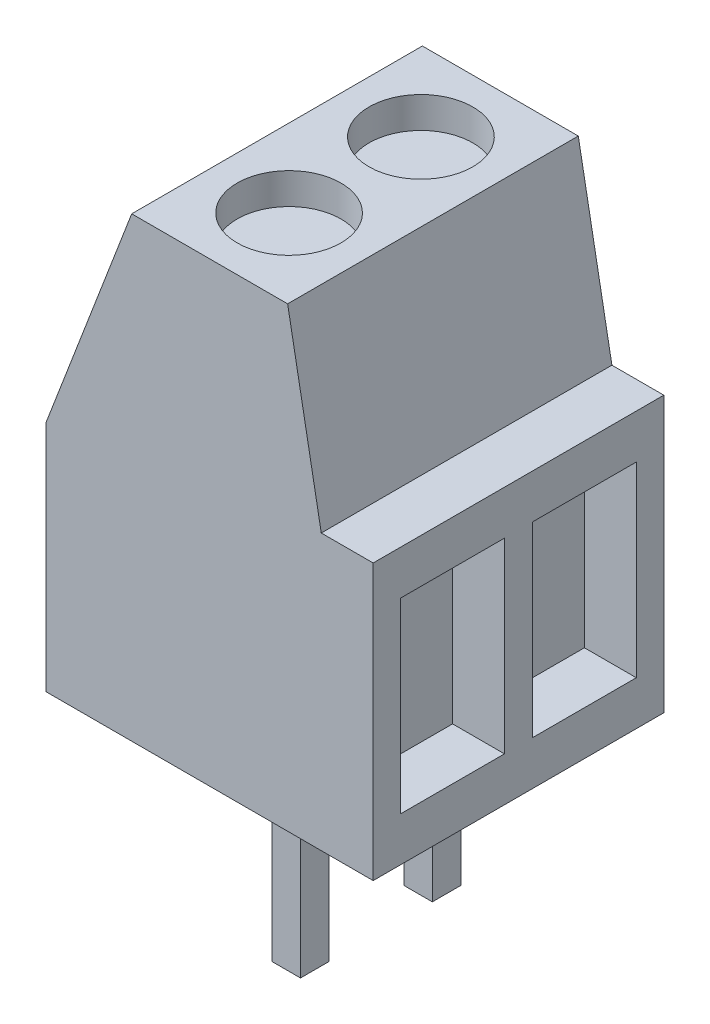
ISO-10303-21;
HEADER;
FILE_DESCRIPTION(('STEP AP214'),'2;1');
FILE_NAME('part.step','',(''),(''),'','','');
FILE_SCHEMA(('AUTOMOTIVE_DESIGN { 1 0 10303 214 1 1 1 1 }'));
ENDSEC;
DATA;
#1=APPLICATION_CONTEXT('core data for automotive mechanical design processes');
#2=APPLICATION_PROTOCOL_DEFINITION('international standard','automotive_design',2000,#1);
#3=PRODUCT_CONTEXT('',#1,'mechanical');
#4=PRODUCT('Part','Part','',(#3));
#5=PRODUCT_RELATED_PRODUCT_CATEGORY('part','',(#4));
#6=PRODUCT_DEFINITION_FORMATION('','',#4);
#7=PRODUCT_DEFINITION_CONTEXT('part definition',#1,'design');
#8=PRODUCT_DEFINITION('design','',#6,#7);
#9=PRODUCT_DEFINITION_SHAPE('','',#8);
#10=(LENGTH_UNIT() NAMED_UNIT(*) SI_UNIT(.MILLI.,.METRE.));
#11=(NAMED_UNIT(*) PLANE_ANGLE_UNIT() SI_UNIT($,.RADIAN.));
#12=(NAMED_UNIT(*) SI_UNIT($,.STERADIAN.) SOLID_ANGLE_UNIT());
#13=UNCERTAINTY_MEASURE_WITH_UNIT(LENGTH_MEASURE(1.E-05),#10,'distance_accuracy_value','');
#14=(GEOMETRIC_REPRESENTATION_CONTEXT(3) GLOBAL_UNCERTAINTY_ASSIGNED_CONTEXT((#13)) GLOBAL_UNIT_ASSIGNED_CONTEXT((#10,
#11,#12)) REPRESENTATION_CONTEXT('',''));
#15=CARTESIAN_POINT('',(0.,0.,0.));
#16=DIRECTION('',(0.,0.,1.));
#17=DIRECTION('',(1.,0.,0.));
#18=AXIS2_PLACEMENT_3D('',#15,#16,#17);
#19=CARTESIAN_POINT('',(2.87500000000013,-3.8,-4.015));
#20=DIRECTION('',(0.,0.,-1.));
#21=DIRECTION('',(-1.,0.,0.));
#22=AXIS2_PLACEMENT_3D('',#19,#20,#21);
#23=PLANE('',#22);
#24=DIRECTION('',(-1.,0.,0.));
#25=VECTOR('',#24,1.);
#26=CARTESIAN_POINT('',(2.87500000000013,0.,-4.015));
#27=LINE('',#26,#25);
#28=CARTESIAN_POINT('',(3.42500000000013,0.,-4.015));
#29=VERTEX_POINT('',#28);
#30=CARTESIAN_POINT('',(2.87500000000013,0.,-4.015));
#31=VERTEX_POINT('',#30);
#32=EDGE_CURVE('E108',#29,#31,#27,.T.);
#33=ORIENTED_EDGE('',*,*,#32,.T.);
#34=DIRECTION('',(0.,1.,0.));
#35=VECTOR('',#34,1.);
#36=CARTESIAN_POINT('',(2.87500000000013,-3.8,-4.015));
#37=LINE('',#36,#35);
#38=CARTESIAN_POINT('',(2.87500000000013,-3.8,-4.015));
#39=VERTEX_POINT('',#38);
#40=EDGE_CURVE('E12',#39,#31,#37,.T.);
#41=ORIENTED_EDGE('',*,*,#40,.F.);
#42=DIRECTION('',(-1.,0.,0.));
#43=VECTOR('',#42,1.);
#44=CARTESIAN_POINT('',(2.87500000000013,-3.8,-4.015));
#45=LINE('',#44,#43);
#46=CARTESIAN_POINT('',(3.42500000000013,-3.8,-4.015));
#47=VERTEX_POINT('',#46);
#48=EDGE_CURVE('E96',#47,#39,#45,.T.);
#49=ORIENTED_EDGE('',*,*,#48,.F.);
#50=DIRECTION('',(0.,1.,0.));
#51=VECTOR('',#50,1.);
#52=CARTESIAN_POINT('',(3.42500000000013,-3.8,-4.015));
#53=LINE('',#52,#51);
#54=EDGE_CURVE('E104',#47,#29,#53,.T.);
#55=ORIENTED_EDGE('',*,*,#54,.T.);
#56=EDGE_LOOP('',(#33,#41,#49,#55));
#57=FACE_BOUND('',#56,.T.);
#58=ADVANCED_FACE('F45',(#57),#23,.F.);
#59=CARTESIAN_POINT('',(2.87500000000013,-3.8,-4.015));
#60=DIRECTION('',(1.,0.,0.));
#61=DIRECTION('',(0.,1.,0.));
#62=AXIS2_PLACEMENT_3D('',#59,#60,#61);
#63=PLANE('',#62);
#64=DIRECTION('',(0.,0.,-1.));
#65=VECTOR('',#64,1.);
#66=CARTESIAN_POINT('',(2.87500000000013,0.,-4.015));
#67=LINE('',#66,#65);
#68=CARTESIAN_POINT('',(2.87500000000013,0.,-4.565));
#69=VERTEX_POINT('',#68);
#70=EDGE_CURVE('E100',#31,#69,#67,.T.);
#71=ORIENTED_EDGE('',*,*,#70,.T.);
#72=DIRECTION('',(0.,1.,0.));
#73=VECTOR('',#72,1.);
#74=CARTESIAN_POINT('',(2.87500000000013,-3.8,-4.565));
#75=LINE('',#74,#73);
#76=CARTESIAN_POINT('',(2.87500000000013,-3.8,-4.565));
#77=VERTEX_POINT('',#76);
#78=EDGE_CURVE('E53',#77,#69,#75,.T.);
#79=ORIENTED_EDGE('',*,*,#78,.F.);
#80=DIRECTION('',(0.,0.,-1.));
#81=VECTOR('',#80,1.);
#82=CARTESIAN_POINT('',(2.87500000000013,-3.8,-4.015));
#83=LINE('',#82,#81);
#84=EDGE_CURVE('E91',#39,#77,#83,.T.);
#85=ORIENTED_EDGE('',*,*,#84,.F.);
#86=ORIENTED_EDGE('',*,*,#40,.T.);
#87=EDGE_LOOP('',(#71,#79,#85,#86));
#88=FACE_BOUND('',#87,.T.);
#89=ADVANCED_FACE('F99',(#88),#63,.F.);
#90=CARTESIAN_POINT('',(2.87500000000013,-3.8,-4.565));
#91=DIRECTION('',(0.,0.,1.));
#92=DIRECTION('',(1.,0.,0.));
#93=AXIS2_PLACEMENT_3D('',#90,#91,#92);
#94=PLANE('',#93);
#95=DIRECTION('',(1.,0.,0.));
#96=VECTOR('',#95,1.);
#97=CARTESIAN_POINT('',(2.87500000000013,0.,-4.565));
#98=LINE('',#97,#96);
#99=CARTESIAN_POINT('',(3.42500000000013,0.,-4.565));
#100=VERTEX_POINT('',#99);
#101=EDGE_CURVE('E78',#69,#100,#98,.T.);
#102=ORIENTED_EDGE('',*,*,#101,.T.);
#103=DIRECTION('',(0.,1.,0.));
#104=VECTOR('',#103,1.);
#105=CARTESIAN_POINT('',(3.42500000000013,-3.8,-4.565));
#106=LINE('',#105,#104);
#107=CARTESIAN_POINT('',(3.42500000000013,-3.8,-4.565));
#108=VERTEX_POINT('',#107);
#109=EDGE_CURVE('E101',#108,#100,#106,.T.);
#110=ORIENTED_EDGE('',*,*,#109,.F.);
#111=DIRECTION('',(1.,0.,0.));
#112=VECTOR('',#111,1.);
#113=CARTESIAN_POINT('',(2.87500000000013,-3.8,-4.565));
#114=LINE('',#113,#112);
#115=EDGE_CURVE('E94',#77,#108,#114,.T.);
#116=ORIENTED_EDGE('',*,*,#115,.F.);
#117=ORIENTED_EDGE('',*,*,#78,.T.);
#118=EDGE_LOOP('',(#102,#110,#116,#117));
#119=FACE_BOUND('',#118,.T.);
#120=ADVANCED_FACE('F102',(#119),#94,.F.);
#121=CARTESIAN_POINT('',(3.42500000000013,-3.8,-4.015));
#122=DIRECTION('',(-1.,0.,0.));
#123=DIRECTION('',(0.,-1.,0.));
#124=AXIS2_PLACEMENT_3D('',#121,#122,#123);
#125=PLANE('',#124);
#126=DIRECTION('',(0.,0.,1.));
#127=VECTOR('',#126,1.);
#128=CARTESIAN_POINT('',(3.42500000000013,0.,-4.015));
#129=LINE('',#128,#127);
#130=EDGE_CURVE('E84',#100,#29,#129,.T.);
#131=ORIENTED_EDGE('',*,*,#130,.T.);
#132=ORIENTED_EDGE('',*,*,#54,.F.);
#133=DIRECTION('',(0.,0.,1.));
#134=VECTOR('',#133,1.);
#135=CARTESIAN_POINT('',(3.42500000000013,-3.8,-4.015));
#136=LINE('',#135,#134);
#137=EDGE_CURVE('E61',#108,#47,#136,.T.);
#138=ORIENTED_EDGE('',*,*,#137,.F.);
#139=ORIENTED_EDGE('',*,*,#109,.T.);
#140=EDGE_LOOP('',(#131,#132,#138,#139));
#141=FACE_BOUND('',#140,.T.);
#142=ADVANCED_FACE('F115',(#141),#125,.F.);
#143=CARTESIAN_POINT('',(0.,-3.8,0.));
#144=DIRECTION('',(0.,1.,0.));
#145=DIRECTION('',(-1.,0.,0.));
#146=AXIS2_PLACEMENT_3D('',#143,#144,#145);
#147=PLANE('',#146);
#148=ORIENTED_EDGE('',*,*,#48,.T.);
#149=ORIENTED_EDGE('',*,*,#84,.T.);
#150=ORIENTED_EDGE('',*,*,#115,.T.);
#151=ORIENTED_EDGE('',*,*,#137,.T.);
#152=EDGE_LOOP('',(#148,#149,#150,#151));
#153=FACE_BOUND('',#152,.T.);
#154=ADVANCED_FACE('F92',(#153),#147,.F.);
#155=CARTESIAN_POINT('',(0.,0.,0.));
#156=DIRECTION('',(0.,1.,0.));
#157=DIRECTION('',(-1.,0.,0.));
#158=AXIS2_PLACEMENT_3D('',#155,#156,#157);
#159=PLANE('',#158);
#160=ORIENTED_EDGE('',*,*,#32,.F.);
#161=ORIENTED_EDGE('',*,*,#130,.F.);
#162=ORIENTED_EDGE('',*,*,#101,.F.);
#163=ORIENTED_EDGE('',*,*,#70,.F.);
#164=EDGE_LOOP('',(#160,#161,#162,#163));
#165=FACE_BOUND('',#164,.T.);
#166=ADVANCED_FACE('F118',(#165),#159,.T.);
#167=CLOSED_SHELL('',(#58,#89,#120,#142,#154,#166));
#168=MANIFOLD_SOLID_BREP('B2',#167);
#169=CARTESIAN_POINT('',(2.875,-3.8,-1.475));
#170=DIRECTION('',(1.,0.,0.));
#171=DIRECTION('',(0.,1.,0.));
#172=AXIS2_PLACEMENT_3D('',#169,#170,#171);
#173=PLANE('',#172);
#174=DIRECTION('',(0.,0.,-1.));
#175=VECTOR('',#174,1.);
#176=CARTESIAN_POINT('',(2.875,0.,-1.475));
#177=LINE('',#176,#175);
#178=CARTESIAN_POINT('',(2.875,0.,-1.475));
#179=VERTEX_POINT('',#178);
#180=CARTESIAN_POINT('',(2.875,0.,-2.025));
#181=VERTEX_POINT('',#180);
#182=EDGE_CURVE('E240',#179,#181,#177,.T.);
#183=ORIENTED_EDGE('',*,*,#182,.T.);
#184=DIRECTION('',(0.,1.,0.));
#185=VECTOR('',#184,1.);
#186=CARTESIAN_POINT('',(2.875,-3.8,-2.025));
#187=LINE('',#186,#185);
#188=CARTESIAN_POINT('',(2.875,-3.8,-2.025));
#189=VERTEX_POINT('',#188);
#190=EDGE_CURVE('E43',#189,#181,#187,.T.);
#191=ORIENTED_EDGE('',*,*,#190,.F.);
#192=DIRECTION('',(0.,0.,-1.));
#193=VECTOR('',#192,1.);
#194=CARTESIAN_POINT('',(2.875,-3.8,-1.475));
#195=LINE('',#194,#193);
#196=CARTESIAN_POINT('',(2.875,-3.8,-1.475));
#197=VERTEX_POINT('',#196);
#198=EDGE_CURVE('E228',#197,#189,#195,.T.);
#199=ORIENTED_EDGE('',*,*,#198,.F.);
#200=DIRECTION('',(0.,1.,0.));
#201=VECTOR('',#200,1.);
#202=CARTESIAN_POINT('',(2.875,-3.8,-1.475));
#203=LINE('',#202,#201);
#204=EDGE_CURVE('E236',#197,#179,#203,.T.);
#205=ORIENTED_EDGE('',*,*,#204,.T.);
#206=EDGE_LOOP('',(#183,#191,#199,#205));
#207=FACE_BOUND('',#206,.T.);
#208=ADVANCED_FACE('F177',(#207),#173,.F.);
#209=CARTESIAN_POINT('',(2.875,-3.8,-2.025));
#210=DIRECTION('',(0.,0.,1.));
#211=DIRECTION('',(1.,0.,0.));
#212=AXIS2_PLACEMENT_3D('',#209,#210,#211);
#213=PLANE('',#212);
#214=DIRECTION('',(1.,0.,0.));
#215=VECTOR('',#214,1.);
#216=CARTESIAN_POINT('',(2.875,0.,-2.025));
#217=LINE('',#216,#215);
#218=CARTESIAN_POINT('',(3.425,0.,-2.025));
#219=VERTEX_POINT('',#218);
#220=EDGE_CURVE('E232',#181,#219,#217,.T.);
#221=ORIENTED_EDGE('',*,*,#220,.T.);
#222=DIRECTION('',(0.,1.,0.));
#223=VECTOR('',#222,1.);
#224=CARTESIAN_POINT('',(3.425,-3.8,-2.025));
#225=LINE('',#224,#223);
#226=CARTESIAN_POINT('',(3.425,-3.8,-2.025));
#227=VERTEX_POINT('',#226);
#228=EDGE_CURVE('E185',#227,#219,#225,.T.);
#229=ORIENTED_EDGE('',*,*,#228,.F.);
#230=DIRECTION('',(1.,0.,0.));
#231=VECTOR('',#230,1.);
#232=CARTESIAN_POINT('',(2.875,-3.8,-2.025));
#233=LINE('',#232,#231);
#234=EDGE_CURVE('E223',#189,#227,#233,.T.);
#235=ORIENTED_EDGE('',*,*,#234,.F.);
#236=ORIENTED_EDGE('',*,*,#190,.T.);
#237=EDGE_LOOP('',(#221,#229,#235,#236));
#238=FACE_BOUND('',#237,.T.);
#239=ADVANCED_FACE('F231',(#238),#213,.F.);
#240=CARTESIAN_POINT('',(3.425,-3.8,-1.475));
#241=DIRECTION('',(-1.,0.,0.));
#242=DIRECTION('',(0.,-1.,0.));
#243=AXIS2_PLACEMENT_3D('',#240,#241,#242);
#244=PLANE('',#243);
#245=DIRECTION('',(0.,0.,1.));
#246=VECTOR('',#245,1.);
#247=CARTESIAN_POINT('',(3.425,0.,-1.475));
#248=LINE('',#247,#246);
#249=CARTESIAN_POINT('',(3.425,0.,-1.475));
#250=VERTEX_POINT('',#249);
#251=EDGE_CURVE('E210',#219,#250,#248,.T.);
#252=ORIENTED_EDGE('',*,*,#251,.T.);
#253=DIRECTION('',(0.,1.,0.));
#254=VECTOR('',#253,1.);
#255=CARTESIAN_POINT('',(3.425,-3.8,-1.475));
#256=LINE('',#255,#254);
#257=CARTESIAN_POINT('',(3.425,-3.8,-1.475));
#258=VERTEX_POINT('',#257);
#259=EDGE_CURVE('E233',#258,#250,#256,.T.);
#260=ORIENTED_EDGE('',*,*,#259,.F.);
#261=DIRECTION('',(0.,0.,1.));
#262=VECTOR('',#261,1.);
#263=CARTESIAN_POINT('',(3.425,-3.8,-1.475));
#264=LINE('',#263,#262);
#265=EDGE_CURVE('E226',#227,#258,#264,.T.);
#266=ORIENTED_EDGE('',*,*,#265,.F.);
#267=ORIENTED_EDGE('',*,*,#228,.T.);
#268=EDGE_LOOP('',(#252,#260,#266,#267));
#269=FACE_BOUND('',#268,.T.);
#270=ADVANCED_FACE('F234',(#269),#244,.F.);
#271=CARTESIAN_POINT('',(2.875,-3.8,-1.475));
#272=DIRECTION('',(0.,0.,-1.));
#273=DIRECTION('',(-1.,0.,0.));
#274=AXIS2_PLACEMENT_3D('',#271,#272,#273);
#275=PLANE('',#274);
#276=DIRECTION('',(-1.,0.,0.));
#277=VECTOR('',#276,1.);
#278=CARTESIAN_POINT('',(2.875,0.,-1.475));
#279=LINE('',#278,#277);
#280=EDGE_CURVE('E216',#250,#179,#279,.T.);
#281=ORIENTED_EDGE('',*,*,#280,.T.);
#282=ORIENTED_EDGE('',*,*,#204,.F.);
#283=DIRECTION('',(-1.,0.,0.));
#284=VECTOR('',#283,1.);
#285=CARTESIAN_POINT('',(2.875,-3.8,-1.475));
#286=LINE('',#285,#284);
#287=EDGE_CURVE('E193',#258,#197,#286,.T.);
#288=ORIENTED_EDGE('',*,*,#287,.F.);
#289=ORIENTED_EDGE('',*,*,#259,.T.);
#290=EDGE_LOOP('',(#281,#282,#288,#289));
#291=FACE_BOUND('',#290,.T.);
#292=ADVANCED_FACE('F247',(#291),#275,.F.);
#293=CARTESIAN_POINT('',(0.,-3.8,0.));
#294=DIRECTION('',(0.,-1.,0.));
#295=DIRECTION('',(1.,0.,0.));
#296=AXIS2_PLACEMENT_3D('',#293,#294,#295);
#297=PLANE('',#296);
#298=ORIENTED_EDGE('',*,*,#198,.T.);
#299=ORIENTED_EDGE('',*,*,#234,.T.);
#300=ORIENTED_EDGE('',*,*,#265,.T.);
#301=ORIENTED_EDGE('',*,*,#287,.T.);
#302=EDGE_LOOP('',(#298,#299,#300,#301));
#303=FACE_BOUND('',#302,.T.);
#304=ADVANCED_FACE('F224',(#303),#297,.T.);
#305=CARTESIAN_POINT('',(0.,0.,0.));
#306=DIRECTION('',(0.,-1.,0.));
#307=DIRECTION('',(1.,0.,0.));
#308=AXIS2_PLACEMENT_3D('',#305,#306,#307);
#309=PLANE('',#308);
#310=ORIENTED_EDGE('',*,*,#182,.F.);
#311=ORIENTED_EDGE('',*,*,#280,.F.);
#312=ORIENTED_EDGE('',*,*,#251,.F.);
#313=ORIENTED_EDGE('',*,*,#220,.F.);
#314=EDGE_LOOP('',(#310,#311,#312,#313));
#315=FACE_BOUND('',#314,.T.);
#316=ADVANCED_FACE('F250',(#315),#309,.F.);
#317=CLOSED_SHELL('',(#208,#239,#270,#292,#304,#316));
#318=MANIFOLD_SOLID_BREP('B6',#317);
#319=CARTESIAN_POINT('',(0.,4.5,-5.6));
#320=DIRECTION('',(-1.,0.,0.));
#321=DIRECTION('',(0.,-1.,0.));
#322=AXIS2_PLACEMENT_3D('',#319,#320,#321);
#323=PLANE('',#322);
#324=DIRECTION('',(0.,-1.,0.));
#325=VECTOR('',#324,1.);
#326=CARTESIAN_POINT('',(0.,4.5,0.));
#327=LINE('',#326,#325);
#328=CARTESIAN_POINT('',(0.,4.5,0.));
#329=VERTEX_POINT('',#328);
#330=CARTESIAN_POINT('',(0.,0.,0.));
#331=VERTEX_POINT('',#330);
#332=EDGE_CURVE('E479',#329,#331,#327,.T.);
#333=ORIENTED_EDGE('',*,*,#332,.F.);
#334=DIRECTION('',(0.,0.,1.));
#335=VECTOR('',#334,1.);
#336=CARTESIAN_POINT('',(0.,4.5,-5.6));
#337=LINE('',#336,#335);
#338=CARTESIAN_POINT('',(0.,4.5,-5.6));
#339=VERTEX_POINT('',#338);
#340=EDGE_CURVE('E175',#339,#329,#337,.T.);
#341=ORIENTED_EDGE('',*,*,#340,.F.);
#342=DIRECTION('',(0.,-1.,0.));
#343=VECTOR('',#342,1.);
#344=CARTESIAN_POINT('',(0.,4.5,-5.6));
#345=LINE('',#344,#343);
#346=CARTESIAN_POINT('',(0.,0.,-5.6));
#347=VERTEX_POINT('',#346);
#348=EDGE_CURVE('E488',#339,#347,#345,.T.);
#349=ORIENTED_EDGE('',*,*,#348,.T.);
#350=DIRECTION('',(0.,0.,1.));
#351=VECTOR('',#350,1.);
#352=CARTESIAN_POINT('',(0.,0.,-5.6));
#353=LINE('',#352,#351);
#354=EDGE_CURVE('E303',#347,#331,#353,.T.);
#355=ORIENTED_EDGE('',*,*,#354,.T.);
#356=EDGE_LOOP('',(#333,#341,#349,#355));
#357=FACE_BOUND('',#356,.T.);
#358=ADVANCED_FACE('F300',(#357),#323,.T.);
#359=CARTESIAN_POINT('',(1.64791190796987,8.8,-5.6));
#360=DIRECTION('',(-0.933776700369476,0.357856219517132,0.));
#361=DIRECTION('',(-0.357856219517132,-0.933776700369476,0.));
#362=AXIS2_PLACEMENT_3D('',#359,#360,#361);
#363=PLANE('',#362);
#364=DIRECTION('',(-0.357856219517132,-0.933776700369476,0.));
#365=VECTOR('',#364,1.);
#366=CARTESIAN_POINT('',(1.64791190796987,8.8,0.));
#367=LINE('',#366,#365);
#368=CARTESIAN_POINT('',(1.64791190796987,8.8,0.));
#369=VERTEX_POINT('',#368);
#370=EDGE_CURVE('E492',#369,#329,#367,.T.);
#371=ORIENTED_EDGE('',*,*,#370,.F.);
#372=DIRECTION('',(0.,0.,1.));
#373=VECTOR('',#372,1.);
#374=CARTESIAN_POINT('',(1.64791190796987,8.8,-5.6));
#375=LINE('',#374,#373);
#376=CARTESIAN_POINT('',(1.64791190796987,8.8,-5.6));
#377=VERTEX_POINT('',#376);
#378=EDGE_CURVE('E308',#377,#369,#375,.T.);
#379=ORIENTED_EDGE('',*,*,#378,.F.);
#380=DIRECTION('',(-0.357856219517132,-0.933776700369476,0.));
#381=VECTOR('',#380,1.);
#382=CARTESIAN_POINT('',(1.64791190796987,8.8,-5.6));
#383=LINE('',#382,#381);
#384=EDGE_CURVE('E507',#377,#339,#383,.T.);
#385=ORIENTED_EDGE('',*,*,#384,.T.);
#386=ORIENTED_EDGE('',*,*,#340,.T.);
#387=EDGE_LOOP('',(#371,#379,#385,#386));
#388=FACE_BOUND('',#387,.T.);
#389=ADVANCED_FACE('F549',(#388),#363,.T.);
#390=CARTESIAN_POINT('',(4.65208809203013,8.8,-5.6));
#391=DIRECTION('',(0.,1.,0.));
#392=DIRECTION('',(0.,0.,1.));
#393=AXIS2_PLACEMENT_3D('',#390,#391,#392);
#394=PLANE('',#393);
#395=CARTESIAN_POINT('',(3.15,8.8,-1.53));
#396=DIRECTION('',(0.,1.,0.));
#397=DIRECTION('',(0.,0.,1.));
#398=AXIS2_PLACEMENT_3D('',#395,#396,#397);
#399=CIRCLE('',#398,0.999999999999999);
#400=CARTESIAN_POINT('',(3.15,8.8,-0.530000000000002));
#401=VERTEX_POINT('',#400);
#402=EDGE_CURVE('E480',#401,#401,#399,.T.);
#403=ORIENTED_EDGE('',*,*,#402,.F.);
#404=EDGE_LOOP('',(#403));
#405=FACE_BOUND('',#404,.T.);
#406=CARTESIAN_POINT('',(3.14999999999999,8.8,-4.07));
#407=DIRECTION('',(0.,1.,0.));
#408=DIRECTION('',(0.,0.,1.));
#409=AXIS2_PLACEMENT_3D('',#406,#407,#408);
#410=CIRCLE('',#409,0.999999999999999);
#411=CARTESIAN_POINT('',(3.14999999999999,8.8,-3.07));
#412=VERTEX_POINT('',#411);
#413=EDGE_CURVE('E443',#412,#412,#410,.T.);
#414=ORIENTED_EDGE('',*,*,#413,.F.);
#415=EDGE_LOOP('',(#414));
#416=FACE_BOUND('',#415,.T.);
#417=DIRECTION('',(-1.,0.,0.));
#418=VECTOR('',#417,1.);
#419=CARTESIAN_POINT('',(4.65208809203013,8.8,0.));
#420=LINE('',#419,#418);
#421=CARTESIAN_POINT('',(4.65208809203013,8.8,0.));
#422=VERTEX_POINT('',#421);
#423=EDGE_CURVE('E524',#422,#369,#420,.T.);
#424=ORIENTED_EDGE('',*,*,#423,.F.);
#425=DIRECTION('',(0.,0.,1.));
#426=VECTOR('',#425,1.);
#427=CARTESIAN_POINT('',(4.65208809203013,8.8,-5.6));
#428=LINE('',#427,#426);
#429=CARTESIAN_POINT('',(4.65208809203013,8.8,-5.6));
#430=VERTEX_POINT('',#429);
#431=EDGE_CURVE('E530',#430,#422,#428,.T.);
#432=ORIENTED_EDGE('',*,*,#431,.F.);
#433=DIRECTION('',(-1.,0.,0.));
#434=VECTOR('',#433,1.);
#435=CARTESIAN_POINT('',(4.65208809203013,8.8,-5.6));
#436=LINE('',#435,#434);
#437=EDGE_CURVE('E504',#430,#377,#436,.T.);
#438=ORIENTED_EDGE('',*,*,#437,.T.);
#439=ORIENTED_EDGE('',*,*,#378,.T.);
#440=EDGE_LOOP('',(#424,#432,#438,#439));
#441=FACE_BOUND('',#440,.T.);
#442=ADVANCED_FACE('F566',(#405,#416,#441),#394,.T.);
#443=CARTESIAN_POINT('',(5.3,5.3,-5.6));
#444=DIRECTION('',(0.983293886037877,0.182025090799402,0.));
#445=DIRECTION('',(-0.182025090799402,0.983293886037877,0.));
#446=AXIS2_PLACEMENT_3D('',#443,#444,#445);
#447=PLANE('',#446);
#448=DIRECTION('',(-0.182025090799402,0.983293886037877,0.));
#449=VECTOR('',#448,1.);
#450=CARTESIAN_POINT('',(5.3,5.3,0.));
#451=LINE('',#450,#449);
#452=CARTESIAN_POINT('',(5.3,5.3,0.));
#453=VERTEX_POINT('',#452);
#454=EDGE_CURVE('E521',#453,#422,#451,.T.);
#455=ORIENTED_EDGE('',*,*,#454,.F.);
#456=DIRECTION('',(0.,0.,1.));
#457=VECTOR('',#456,1.);
#458=CARTESIAN_POINT('',(5.3,5.3,-5.6));
#459=LINE('',#458,#457);
#460=CARTESIAN_POINT('',(5.3,5.3,-5.6));
#461=VERTEX_POINT('',#460);
#462=EDGE_CURVE('E532',#461,#453,#459,.T.);
#463=ORIENTED_EDGE('',*,*,#462,.F.);
#464=DIRECTION('',(-0.182025090799402,0.983293886037877,0.));
#465=VECTOR('',#464,1.);
#466=CARTESIAN_POINT('',(5.3,5.3,-5.6));
#467=LINE('',#466,#465);
#468=EDGE_CURVE('E501',#461,#430,#467,.T.);
#469=ORIENTED_EDGE('',*,*,#468,.T.);
#470=ORIENTED_EDGE('',*,*,#431,.T.);
#471=EDGE_LOOP('',(#455,#463,#469,#470));
#472=FACE_BOUND('',#471,.T.);
#473=ADVANCED_FACE('F564',(#472),#447,.T.);
#474=CARTESIAN_POINT('',(6.3,5.3,-5.6));
#475=DIRECTION('',(0.,1.,0.));
#476=DIRECTION('',(0.,0.,1.));
#477=AXIS2_PLACEMENT_3D('',#474,#475,#476);
#478=PLANE('',#477);
#479=DIRECTION('',(-1.,0.,0.));
#480=VECTOR('',#479,1.);
#481=CARTESIAN_POINT('',(6.3,5.3,0.));
#482=LINE('',#481,#480);
#483=CARTESIAN_POINT('',(6.3,5.3,0.));
#484=VERTEX_POINT('',#483);
#485=EDGE_CURVE('E518',#484,#453,#482,.T.);
#486=ORIENTED_EDGE('',*,*,#485,.F.);
#487=DIRECTION('',(0.,0.,1.));
#488=VECTOR('',#487,1.);
#489=CARTESIAN_POINT('',(6.3,5.3,-5.6));
#490=LINE('',#489,#488);
#491=CARTESIAN_POINT('',(6.3,5.3,-5.6));
#492=VERTEX_POINT('',#491);
#493=EDGE_CURVE('E534',#492,#484,#490,.T.);
#494=ORIENTED_EDGE('',*,*,#493,.F.);
#495=DIRECTION('',(-1.,0.,0.));
#496=VECTOR('',#495,1.);
#497=CARTESIAN_POINT('',(6.3,5.3,-5.6));
#498=LINE('',#497,#496);
#499=EDGE_CURVE('E498',#492,#461,#498,.T.);
#500=ORIENTED_EDGE('',*,*,#499,.T.);
#501=ORIENTED_EDGE('',*,*,#462,.T.);
#502=EDGE_LOOP('',(#486,#494,#500,#501));
#503=FACE_BOUND('',#502,.T.);
#504=ADVANCED_FACE('F562',(#503),#478,.T.);
#505=CARTESIAN_POINT('',(6.3,5.3,-5.6));
#506=DIRECTION('',(1.,0.,0.));
#507=DIRECTION('',(0.,0.,-1.));
#508=AXIS2_PLACEMENT_3D('',#505,#506,#507);
#509=PLANE('',#508);
#510=DIRECTION('',(0.,-1.,0.));
#511=VECTOR('',#510,1.);
#512=CARTESIAN_POINT('',(6.3,0.85,-0.53));
#513=LINE('',#512,#511);
#514=CARTESIAN_POINT('',(6.3,4.45,-0.53));
#515=VERTEX_POINT('',#514);
#516=CARTESIAN_POINT('',(6.3,0.85,-0.529999999999999));
#517=VERTEX_POINT('',#516);
#518=EDGE_CURVE('E316',#515,#517,#513,.T.);
#519=ORIENTED_EDGE('',*,*,#518,.F.);
#520=DIRECTION('',(0.,0.,1.));
#521=VECTOR('',#520,1.);
#522=CARTESIAN_POINT('',(6.3,4.45,-0.53));
#523=LINE('',#522,#521);
#524=CARTESIAN_POINT('',(6.3,4.45,-2.53));
#525=VERTEX_POINT('',#524);
#526=EDGE_CURVE('E427',#525,#515,#523,.T.);
#527=ORIENTED_EDGE('',*,*,#526,.F.);
#528=DIRECTION('',(0.,1.,0.));
#529=VECTOR('',#528,1.);
#530=CARTESIAN_POINT('',(6.3,0.85,-2.53));
#531=LINE('',#530,#529);
#532=CARTESIAN_POINT('',(6.3,0.85,-2.53));
#533=VERTEX_POINT('',#532);
#534=EDGE_CURVE('E430',#533,#525,#531,.T.);
#535=ORIENTED_EDGE('',*,*,#534,.F.);
#536=DIRECTION('',(0.,0.,-1.));
#537=VECTOR('',#536,1.);
#538=CARTESIAN_POINT('',(6.3,0.85,-0.53));
#539=LINE('',#538,#537);
#540=EDGE_CURVE('E436',#517,#533,#539,.T.);
#541=ORIENTED_EDGE('',*,*,#540,.F.);
#542=EDGE_LOOP('',(#519,#527,#535,#541));
#543=FACE_BOUND('',#542,.T.);
#544=DIRECTION('',(0.,-1.,0.));
#545=VECTOR('',#544,1.);
#546=CARTESIAN_POINT('',(6.3,0.85,-3.07));
#547=LINE('',#546,#545);
#548=CARTESIAN_POINT('',(6.3,4.45,-3.07));
#549=VERTEX_POINT('',#548);
#550=CARTESIAN_POINT('',(6.3,0.85,-3.07));
#551=VERTEX_POINT('',#550);
#552=EDGE_CURVE('E324',#549,#551,#547,.T.);
#553=ORIENTED_EDGE('',*,*,#552,.F.);
#554=DIRECTION('',(0.,0.,1.));
#555=VECTOR('',#554,1.);
#556=CARTESIAN_POINT('',(6.3,4.45,-3.07));
#557=LINE('',#556,#555);
#558=CARTESIAN_POINT('',(6.3,4.45,-5.07));
#559=VERTEX_POINT('',#558);
#560=EDGE_CURVE('E451',#559,#549,#557,.T.);
#561=ORIENTED_EDGE('',*,*,#560,.F.);
#562=DIRECTION('',(0.,1.,0.));
#563=VECTOR('',#562,1.);
#564=CARTESIAN_POINT('',(6.3,0.85,-5.07));
#565=LINE('',#564,#563);
#566=CARTESIAN_POINT('',(6.3,0.85,-5.07));
#567=VERTEX_POINT('',#566);
#568=EDGE_CURVE('E465',#567,#559,#565,.T.);
#569=ORIENTED_EDGE('',*,*,#568,.F.);
#570=DIRECTION('',(0.,0.,-1.));
#571=VECTOR('',#570,1.);
#572=CARTESIAN_POINT('',(6.3,0.85,-3.07));
#573=LINE('',#572,#571);
#574=EDGE_CURVE('E462',#551,#567,#573,.T.);
#575=ORIENTED_EDGE('',*,*,#574,.F.);
#576=EDGE_LOOP('',(#553,#561,#569,#575));
#577=FACE_BOUND('',#576,.T.);
#578=DIRECTION('',(0.,1.,0.));
#579=VECTOR('',#578,1.);
#580=CARTESIAN_POINT('',(6.3,5.3,0.));
#581=LINE('',#580,#579);
#582=CARTESIAN_POINT('',(6.3,0.,0.));
#583=VERTEX_POINT('',#582);
#584=EDGE_CURVE('E515',#583,#484,#581,.T.);
#585=ORIENTED_EDGE('',*,*,#584,.F.);
#586=DIRECTION('',(0.,0.,1.));
#587=VECTOR('',#586,1.);
#588=CARTESIAN_POINT('',(6.3,0.,-5.6));
#589=LINE('',#588,#587);
#590=CARTESIAN_POINT('',(6.3,0.,-5.6));
#591=VERTEX_POINT('',#590);
#592=EDGE_CURVE('E535',#591,#583,#589,.T.);
#593=ORIENTED_EDGE('',*,*,#592,.F.);
#594=DIRECTION('',(0.,1.,0.));
#595=VECTOR('',#594,1.);
#596=CARTESIAN_POINT('',(6.3,5.3,-5.6));
#597=LINE('',#596,#595);
#598=EDGE_CURVE('E495',#591,#492,#597,.T.);
#599=ORIENTED_EDGE('',*,*,#598,.T.);
#600=ORIENTED_EDGE('',*,*,#493,.T.);
#601=EDGE_LOOP('',(#585,#593,#599,#600));
#602=FACE_BOUND('',#601,.T.);
#603=ADVANCED_FACE('F558',(#543,#577,#602),#509,.T.);
#604=CARTESIAN_POINT('',(6.3,0.,-5.6));
#605=DIRECTION('',(0.,-1.,0.));
#606=DIRECTION('',(1.,0.,0.));
#607=AXIS2_PLACEMENT_3D('',#604,#605,#606);
#608=PLANE('',#607);
#609=DIRECTION('',(1.,0.,0.));
#610=VECTOR('',#609,1.);
#611=CARTESIAN_POINT('',(6.3,0.,0.));
#612=LINE('',#611,#610);
#613=EDGE_CURVE('E512',#331,#583,#612,.T.);
#614=ORIENTED_EDGE('',*,*,#613,.F.);
#615=ORIENTED_EDGE('',*,*,#354,.F.);
#616=DIRECTION('',(1.,0.,0.));
#617=VECTOR('',#616,1.);
#618=CARTESIAN_POINT('',(6.3,0.,-5.6));
#619=LINE('',#618,#617);
#620=EDGE_CURVE('E491',#347,#591,#619,.T.);
#621=ORIENTED_EDGE('',*,*,#620,.T.);
#622=ORIENTED_EDGE('',*,*,#592,.T.);
#623=EDGE_LOOP('',(#614,#615,#621,#622));
#624=FACE_BOUND('',#623,.T.);
#625=ADVANCED_FACE('F543',(#624),#608,.T.);
#626=CARTESIAN_POINT('',(0.,0.,-5.6));
#627=DIRECTION('',(0.,0.,-1.));
#628=DIRECTION('',(-1.,0.,0.));
#629=AXIS2_PLACEMENT_3D('',#626,#627,#628);
#630=PLANE('',#629);
#631=ORIENTED_EDGE('',*,*,#348,.F.);
#632=ORIENTED_EDGE('',*,*,#384,.F.);
#633=ORIENTED_EDGE('',*,*,#437,.F.);
#634=ORIENTED_EDGE('',*,*,#468,.F.);
#635=ORIENTED_EDGE('',*,*,#499,.F.);
#636=ORIENTED_EDGE('',*,*,#598,.F.);
#637=ORIENTED_EDGE('',*,*,#620,.F.);
#638=EDGE_LOOP('',(#631,#632,#633,#634,#635,#636,#637));
#639=FACE_BOUND('',#638,.T.);
#640=ADVANCED_FACE('F552',(#639),#630,.T.);
#641=CARTESIAN_POINT('',(0.,0.,0.));
#642=DIRECTION('',(0.,0.,-1.));
#643=DIRECTION('',(-1.,0.,0.));
#644=AXIS2_PLACEMENT_3D('',#641,#642,#643);
#645=PLANE('',#644);
#646=ORIENTED_EDGE('',*,*,#332,.T.);
#647=ORIENTED_EDGE('',*,*,#613,.T.);
#648=ORIENTED_EDGE('',*,*,#584,.T.);
#649=ORIENTED_EDGE('',*,*,#485,.T.);
#650=ORIENTED_EDGE('',*,*,#454,.T.);
#651=ORIENTED_EDGE('',*,*,#423,.T.);
#652=ORIENTED_EDGE('',*,*,#370,.T.);
#653=EDGE_LOOP('',(#646,#647,#648,#649,#650,#651,#652));
#654=FACE_BOUND('',#653,.T.);
#655=ADVANCED_FACE('F545',(#654),#645,.F.);
#656=CARTESIAN_POINT('',(3.14999999999999,8.2,-4.07));
#657=DIRECTION('',(0.,1.,0.));
#658=DIRECTION('',(0.,0.,1.));
#659=AXIS2_PLACEMENT_3D('',#656,#657,#658);
#660=CYLINDRICAL_SURFACE('',#659,0.999999999999999);
#661=CARTESIAN_POINT('',(3.14999999999999,8.2,-4.07));
#662=DIRECTION('',(0.,1.,0.));
#663=DIRECTION('',(0.,0.,1.));
#664=AXIS2_PLACEMENT_3D('',#661,#662,#663);
#665=CIRCLE('',#664,0.999999999999999);
#666=CARTESIAN_POINT('',(3.14999999999999,8.2,-3.07));
#667=VERTEX_POINT('',#666);
#668=EDGE_CURVE('E483',#667,#667,#665,.T.);
#669=ORIENTED_EDGE('',*,*,#668,.F.);
#670=EDGE_LOOP('',(#669));
#671=FACE_BOUND('',#670,.T.);
#672=ORIENTED_EDGE('',*,*,#413,.T.);
#673=EDGE_LOOP('',(#672));
#674=FACE_BOUND('',#673,.T.);
#675=ADVANCED_FACE('F625',(#671,#674),#660,.F.);
#676=CARTESIAN_POINT('',(3.14999999999999,8.2,-4.07));
#677=DIRECTION('',(0.,1.,0.));
#678=DIRECTION('',(0.,0.,1.));
#679=AXIS2_PLACEMENT_3D('',#676,#677,#678);
#680=PLANE('',#679);
#681=ORIENTED_EDGE('',*,*,#668,.T.);
#682=EDGE_LOOP('',(#681));
#683=FACE_BOUND('',#682,.T.);
#684=ADVANCED_FACE('F638',(#683),#680,.T.);
#685=CARTESIAN_POINT('',(3.15,8.2,-1.53));
#686=DIRECTION('',(0.,1.,0.));
#687=DIRECTION('',(0.,0.,1.));
#688=AXIS2_PLACEMENT_3D('',#685,#686,#687);
#689=CYLINDRICAL_SURFACE('',#688,0.999999999999999);
#690=CARTESIAN_POINT('',(3.15,8.2,-1.53));
#691=DIRECTION('',(0.,1.,0.));
#692=DIRECTION('',(0.,0.,1.));
#693=AXIS2_PLACEMENT_3D('',#690,#691,#692);
#694=CIRCLE('',#693,0.999999999999999);
#695=CARTESIAN_POINT('',(3.15,8.2,-0.530000000000002));
#696=VERTEX_POINT('',#695);
#697=EDGE_CURVE('E476',#696,#696,#694,.T.);
#698=ORIENTED_EDGE('',*,*,#697,.F.);
#699=EDGE_LOOP('',(#698));
#700=FACE_BOUND('',#699,.T.);
#701=ORIENTED_EDGE('',*,*,#402,.T.);
#702=EDGE_LOOP('',(#701));
#703=FACE_BOUND('',#702,.T.);
#704=ADVANCED_FACE('F649',(#700,#703),#689,.F.);
#705=CARTESIAN_POINT('',(3.15,8.2,-1.53));
#706=DIRECTION('',(0.,1.,0.));
#707=DIRECTION('',(0.,0.,1.));
#708=AXIS2_PLACEMENT_3D('',#705,#706,#707);
#709=PLANE('',#708);
#710=ORIENTED_EDGE('',*,*,#697,.T.);
#711=EDGE_LOOP('',(#710));
#712=FACE_BOUND('',#711,.T.);
#713=ADVANCED_FACE('F661',(#712),#709,.T.);
#714=CARTESIAN_POINT('',(5.3,0.85,-3.07));
#715=DIRECTION('',(0.,0.,1.));
#716=DIRECTION('',(1.,0.,0.));
#717=AXIS2_PLACEMENT_3D('',#714,#715,#716);
#718=PLANE('',#717);
#719=ORIENTED_EDGE('',*,*,#552,.T.);
#720=DIRECTION('',(1.,0.,0.));
#721=VECTOR('',#720,1.);
#722=CARTESIAN_POINT('',(5.3,0.85,-3.07));
#723=LINE('',#722,#721);
#724=CARTESIAN_POINT('',(5.3,0.85,-3.07));
#725=VERTEX_POINT('',#724);
#726=EDGE_CURVE('E460',#725,#551,#723,.T.);
#727=ORIENTED_EDGE('',*,*,#726,.F.);
#728=DIRECTION('',(0.,-1.,0.));
#729=VECTOR('',#728,1.);
#730=CARTESIAN_POINT('',(5.3,0.85,-3.07));
#731=LINE('',#730,#729);
#732=CARTESIAN_POINT('',(5.3,4.45,-3.07));
#733=VERTEX_POINT('',#732);
#734=EDGE_CURVE('E447',#733,#725,#731,.T.);
#735=ORIENTED_EDGE('',*,*,#734,.F.);
#736=DIRECTION('',(1.,0.,0.));
#737=VECTOR('',#736,1.);
#738=CARTESIAN_POINT('',(5.3,4.45,-3.07));
#739=LINE('',#738,#737);
#740=EDGE_CURVE('E437',#733,#549,#739,.T.);
#741=ORIENTED_EDGE('',*,*,#740,.T.);
#742=EDGE_LOOP('',(#719,#727,#735,#741));
#743=FACE_BOUND('',#742,.T.);
#744=ADVANCED_FACE('F671',(#743),#718,.F.);
#745=CARTESIAN_POINT('',(5.3,4.45,-3.07));
#746=DIRECTION('',(0.,1.,0.));
#747=DIRECTION('',(0.,0.,1.));
#748=AXIS2_PLACEMENT_3D('',#745,#746,#747);
#749=PLANE('',#748);
#750=ORIENTED_EDGE('',*,*,#560,.T.);
#751=ORIENTED_EDGE('',*,*,#740,.F.);
#752=DIRECTION('',(0.,0.,1.));
#753=VECTOR('',#752,1.);
#754=CARTESIAN_POINT('',(5.3,4.45,-3.07));
#755=LINE('',#754,#753);
#756=CARTESIAN_POINT('',(5.3,4.45,-5.07));
#757=VERTEX_POINT('',#756);
#758=EDGE_CURVE('E457',#757,#733,#755,.T.);
#759=ORIENTED_EDGE('',*,*,#758,.F.);
#760=DIRECTION('',(1.,0.,0.));
#761=VECTOR('',#760,1.);
#762=CARTESIAN_POINT('',(5.3,4.45,-5.07));
#763=LINE('',#762,#761);
#764=EDGE_CURVE('E471',#757,#559,#763,.T.);
#765=ORIENTED_EDGE('',*,*,#764,.T.);
#766=EDGE_LOOP('',(#750,#751,#759,#765));
#767=FACE_BOUND('',#766,.T.);
#768=ADVANCED_FACE('F688',(#767),#749,.F.);
#769=CARTESIAN_POINT('',(5.3,0.85,-5.07));
#770=DIRECTION('',(0.,0.,-1.));
#771=DIRECTION('',(-1.,0.,0.));
#772=AXIS2_PLACEMENT_3D('',#769,#770,#771);
#773=PLANE('',#772);
#774=ORIENTED_EDGE('',*,*,#568,.T.);
#775=ORIENTED_EDGE('',*,*,#764,.F.);
#776=DIRECTION('',(0.,1.,0.));
#777=VECTOR('',#776,1.);
#778=CARTESIAN_POINT('',(5.3,0.85,-5.07));
#779=LINE('',#778,#777);
#780=CARTESIAN_POINT('',(5.3,0.85,-5.07));
#781=VERTEX_POINT('',#780);
#782=EDGE_CURVE('E454',#781,#757,#779,.T.);
#783=ORIENTED_EDGE('',*,*,#782,.F.);
#784=DIRECTION('',(1.,0.,0.));
#785=VECTOR('',#784,1.);
#786=CARTESIAN_POINT('',(5.3,0.85,-5.07));
#787=LINE('',#786,#785);
#788=EDGE_CURVE('E473',#781,#567,#787,.T.);
#789=ORIENTED_EDGE('',*,*,#788,.T.);
#790=EDGE_LOOP('',(#774,#775,#783,#789));
#791=FACE_BOUND('',#790,.T.);
#792=ADVANCED_FACE('F697',(#791),#773,.F.);
#793=CARTESIAN_POINT('',(5.3,0.85,-3.07));
#794=DIRECTION('',(0.,-1.,0.));
#795=DIRECTION('',(0.,0.,-1.));
#796=AXIS2_PLACEMENT_3D('',#793,#794,#795);
#797=PLANE('',#796);
#798=ORIENTED_EDGE('',*,*,#574,.T.);
#799=ORIENTED_EDGE('',*,*,#788,.F.);
#800=DIRECTION('',(0.,0.,-1.));
#801=VECTOR('',#800,1.);
#802=CARTESIAN_POINT('',(5.3,0.85,-3.07));
#803=LINE('',#802,#801);
#804=EDGE_CURVE('E450',#725,#781,#803,.T.);
#805=ORIENTED_EDGE('',*,*,#804,.F.);
#806=ORIENTED_EDGE('',*,*,#726,.T.);
#807=EDGE_LOOP('',(#798,#799,#805,#806));
#808=FACE_BOUND('',#807,.T.);
#809=ADVANCED_FACE('F707',(#808),#797,.F.);
#810=CARTESIAN_POINT('',(5.3,0.,0.));
#811=DIRECTION('',(-1.,0.,0.));
#812=DIRECTION('',(0.,0.,1.));
#813=AXIS2_PLACEMENT_3D('',#810,#811,#812);
#814=PLANE('',#813);
#815=ORIENTED_EDGE('',*,*,#734,.T.);
#816=ORIENTED_EDGE('',*,*,#804,.T.);
#817=ORIENTED_EDGE('',*,*,#782,.T.);
#818=ORIENTED_EDGE('',*,*,#758,.T.);
#819=EDGE_LOOP('',(#815,#816,#817,#818));
#820=FACE_BOUND('',#819,.T.);
#821=ADVANCED_FACE('F717',(#820),#814,.F.);
#822=CARTESIAN_POINT('',(5.3,0.85,-0.53));
#823=DIRECTION('',(0.,0.,1.));
#824=DIRECTION('',(0.,-1.,0.));
#825=AXIS2_PLACEMENT_3D('',#822,#823,#824);
#826=PLANE('',#825);
#827=ORIENTED_EDGE('',*,*,#518,.T.);
#828=DIRECTION('',(1.,0.,0.));
#829=VECTOR('',#828,1.);
#830=CARTESIAN_POINT('',(5.3,0.85,-0.53));
#831=LINE('',#830,#829);
#832=CARTESIAN_POINT('',(5.3,0.85,-0.53));
#833=VERTEX_POINT('',#832);
#834=EDGE_CURVE('E405',#833,#517,#831,.T.);
#835=ORIENTED_EDGE('',*,*,#834,.F.);
#836=DIRECTION('',(0.,-1.,0.));
#837=VECTOR('',#836,1.);
#838=CARTESIAN_POINT('',(5.3,0.85,-0.53));
#839=LINE('',#838,#837);
#840=CARTESIAN_POINT('',(5.3,4.45,-0.53));
#841=VERTEX_POINT('',#840);
#842=EDGE_CURVE('E409',#841,#833,#839,.T.);
#843=ORIENTED_EDGE('',*,*,#842,.F.);
#844=DIRECTION('',(1.,0.,0.));
#845=VECTOR('',#844,1.);
#846=CARTESIAN_POINT('',(5.3,4.45,-0.53));
#847=LINE('',#846,#845);
#848=EDGE_CURVE('E441',#841,#515,#847,.T.);
#849=ORIENTED_EDGE('',*,*,#848,.T.);
#850=EDGE_LOOP('',(#827,#835,#843,#849));
#851=FACE_BOUND('',#850,.T.);
#852=ADVANCED_FACE('F407',(#851),#826,.F.);
#853=CARTESIAN_POINT('',(5.3,4.45,-0.53));
#854=DIRECTION('',(0.,1.,0.));
#855=DIRECTION('',(0.,0.,1.));
#856=AXIS2_PLACEMENT_3D('',#853,#854,#855);
#857=PLANE('',#856);
#858=ORIENTED_EDGE('',*,*,#526,.T.);
#859=ORIENTED_EDGE('',*,*,#848,.F.);
#860=DIRECTION('',(0.,0.,1.));
#861=VECTOR('',#860,1.);
#862=CARTESIAN_POINT('',(5.3,4.45,-0.53));
#863=LINE('',#862,#861);
#864=CARTESIAN_POINT('',(5.3,4.45,-2.53));
#865=VERTEX_POINT('',#864);
#866=EDGE_CURVE('E415',#865,#841,#863,.T.);
#867=ORIENTED_EDGE('',*,*,#866,.F.);
#868=DIRECTION('',(1.,0.,0.));
#869=VECTOR('',#868,1.);
#870=CARTESIAN_POINT('',(5.3,4.45,-2.53));
#871=LINE('',#870,#869);
#872=EDGE_CURVE('E444',#865,#525,#871,.T.);
#873=ORIENTED_EDGE('',*,*,#872,.T.);
#874=EDGE_LOOP('',(#858,#859,#867,#873));
#875=FACE_BOUND('',#874,.T.);
#876=ADVANCED_FACE('F737',(#875),#857,.F.);
#877=CARTESIAN_POINT('',(5.3,0.85,-2.53));
#878=DIRECTION('',(0.,0.,-1.));
#879=DIRECTION('',(0.,1.,0.));
#880=AXIS2_PLACEMENT_3D('',#877,#878,#879);
#881=PLANE('',#880);
#882=ORIENTED_EDGE('',*,*,#534,.T.);
#883=ORIENTED_EDGE('',*,*,#872,.F.);
#884=DIRECTION('',(0.,1.,0.));
#885=VECTOR('',#884,1.);
#886=CARTESIAN_POINT('',(5.3,0.85,-2.53));
#887=LINE('',#886,#885);
#888=CARTESIAN_POINT('',(5.3,0.85,-2.53));
#889=VERTEX_POINT('',#888);
#890=EDGE_CURVE('E423',#889,#865,#887,.T.);
#891=ORIENTED_EDGE('',*,*,#890,.F.);
#892=DIRECTION('',(1.,0.,0.));
#893=VECTOR('',#892,1.);
#894=CARTESIAN_POINT('',(5.3,0.85,-2.53));
#895=LINE('',#894,#893);
#896=EDGE_CURVE('E414',#889,#533,#895,.T.);
#897=ORIENTED_EDGE('',*,*,#896,.T.);
#898=EDGE_LOOP('',(#882,#883,#891,#897));
#899=FACE_BOUND('',#898,.T.);
#900=ADVANCED_FACE('F746',(#899),#881,.F.);
#901=CARTESIAN_POINT('',(5.3,0.85,-0.53));
#902=DIRECTION('',(0.,-1.,0.));
#903=DIRECTION('',(0.,0.,-1.));
#904=AXIS2_PLACEMENT_3D('',#901,#902,#903);
#905=PLANE('',#904);
#906=ORIENTED_EDGE('',*,*,#540,.T.);
#907=ORIENTED_EDGE('',*,*,#896,.F.);
#908=DIRECTION('',(0.,0.,-1.));
#909=VECTOR('',#908,1.);
#910=CARTESIAN_POINT('',(5.3,0.85,-0.53));
#911=LINE('',#910,#909);
#912=EDGE_CURVE('E418',#833,#889,#911,.T.);
#913=ORIENTED_EDGE('',*,*,#912,.F.);
#914=ORIENTED_EDGE('',*,*,#834,.T.);
#915=EDGE_LOOP('',(#906,#907,#913,#914));
#916=FACE_BOUND('',#915,.T.);
#917=ADVANCED_FACE('F419',(#916),#905,.F.);
#918=CARTESIAN_POINT('',(5.3,0.,0.));
#919=DIRECTION('',(-1.,0.,0.));
#920=DIRECTION('',(0.,0.,1.));
#921=AXIS2_PLACEMENT_3D('',#918,#919,#920);
#922=PLANE('',#921);
#923=ORIENTED_EDGE('',*,*,#842,.T.);
#924=ORIENTED_EDGE('',*,*,#912,.T.);
#925=ORIENTED_EDGE('',*,*,#890,.T.);
#926=ORIENTED_EDGE('',*,*,#866,.T.);
#927=EDGE_LOOP('',(#923,#924,#925,#926));
#928=FACE_BOUND('',#927,.T.);
#929=ADVANCED_FACE('F425',(#928),#922,.F.);
#930=CLOSED_SHELL('',(#358,#389,#442,#473,#504,#603,#625,#640,#655,#675,#684,#704,#713,#744,
#768,#792,#809,#821,#852,#876,#900,#917,#929));
#931=MANIFOLD_SOLID_BREP('B37',#930);
#932=ADVANCED_BREP_SHAPE_REPRESENTATION('',(#18,#168,#318,#931),#14);
#933=SHAPE_DEFINITION_REPRESENTATION(#9,#932);
ENDSEC;
END-ISO-10303-21;
